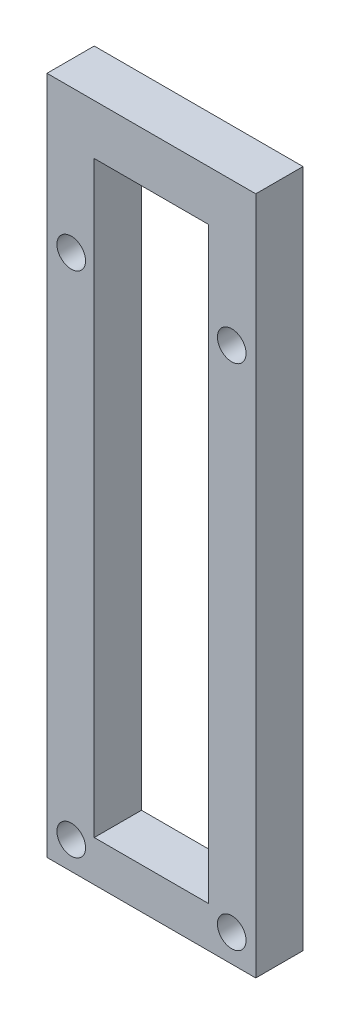
ISO-10303-21;
HEADER;
FILE_DESCRIPTION(('STEP AP214'),'2;1');
FILE_NAME('part.step','',(''),(''),'','','');
FILE_SCHEMA(('AUTOMOTIVE_DESIGN { 1 0 10303 214 1 1 1 1 }'));
ENDSEC;
DATA;
#1=APPLICATION_CONTEXT('core data for automotive mechanical design processes');
#2=APPLICATION_PROTOCOL_DEFINITION('international standard','automotive_design',2000,#1);
#3=PRODUCT_CONTEXT('',#1,'mechanical');
#4=PRODUCT('Part','Part','',(#3));
#5=PRODUCT_RELATED_PRODUCT_CATEGORY('part','',(#4));
#6=PRODUCT_DEFINITION_FORMATION('','',#4);
#7=PRODUCT_DEFINITION_CONTEXT('part definition',#1,'design');
#8=PRODUCT_DEFINITION('design','',#6,#7);
#9=PRODUCT_DEFINITION_SHAPE('','',#8);
#10=(LENGTH_UNIT() NAMED_UNIT(*) SI_UNIT(.MILLI.,.METRE.));
#11=(NAMED_UNIT(*) PLANE_ANGLE_UNIT() SI_UNIT($,.RADIAN.));
#12=(NAMED_UNIT(*) SI_UNIT($,.STERADIAN.) SOLID_ANGLE_UNIT());
#13=UNCERTAINTY_MEASURE_WITH_UNIT(LENGTH_MEASURE(1.E-05),#10,'distance_accuracy_value','');
#14=(GEOMETRIC_REPRESENTATION_CONTEXT(3) GLOBAL_UNCERTAINTY_ASSIGNED_CONTEXT((#13)) GLOBAL_UNIT_ASSIGNED_CONTEXT((#10,
#11,#12)) REPRESENTATION_CONTEXT('',''));
#15=CARTESIAN_POINT('',(0.,0.,0.));
#16=DIRECTION('',(0.,0.,1.));
#17=DIRECTION('',(1.,0.,0.));
#18=AXIS2_PLACEMENT_3D('',#15,#16,#17);
#19=CARTESIAN_POINT('',(-6.6,94.86,6.6));
#20=DIRECTION('',(1.,0.,0.));
#21=DIRECTION('',(0.,1.,0.));
#22=AXIS2_PLACEMENT_3D('',#19,#20,#21);
#23=PLANE('',#22);
#24=DIRECTION('',(0.,0.,-1.));
#25=VECTOR('',#24,1.);
#26=CARTESIAN_POINT('',(-6.59999999999172,87.8560754392765,6.6));
#27=LINE('',#26,#25);
#28=CARTESIAN_POINT('',(-6.6,87.8560754392765,6.6));
#29=VERTEX_POINT('',#28);
#30=CARTESIAN_POINT('',(-6.59999999999172,87.8560754392765,0.));
#31=VERTEX_POINT('',#30);
#32=EDGE_CURVE('E114',#29,#31,#27,.T.);
#33=ORIENTED_EDGE('',*,*,#32,.T.);
#34=DIRECTION('',(0.,-1.,0.));
#35=VECTOR('',#34,1.);
#36=CARTESIAN_POINT('',(-6.6,94.86,0.));
#37=LINE('',#36,#35);
#38=CARTESIAN_POINT('',(-6.59999999999999,5.70999999999999,0.));
#39=VERTEX_POINT('',#38);
#40=EDGE_CURVE('E104',#31,#39,#37,.T.);
#41=ORIENTED_EDGE('',*,*,#40,.T.);
#42=DIRECTION('',(0.,0.,-1.));
#43=VECTOR('',#42,1.);
#44=CARTESIAN_POINT('',(-6.59999999999999,5.70999999999999,6.6));
#45=LINE('',#44,#43);
#46=CARTESIAN_POINT('',(-6.59999999999999,5.70999999999999,6.6));
#47=VERTEX_POINT('',#46);
#48=EDGE_CURVE('E161',#47,#39,#45,.T.);
#49=ORIENTED_EDGE('',*,*,#48,.F.);
#50=DIRECTION('',(0.,-1.,0.));
#51=VECTOR('',#50,1.);
#52=CARTESIAN_POINT('',(-6.6,94.86,6.6));
#53=LINE('',#52,#51);
#54=EDGE_CURVE('E60',#29,#47,#53,.T.);
#55=ORIENTED_EDGE('',*,*,#54,.F.);
#56=EDGE_LOOP('',(#33,#41,#49,#55));
#57=FACE_BOUND('',#56,.T.);
#58=ADVANCED_FACE('F35',(#57),#23,.F.);
#59=CARTESIAN_POINT('',(-22.56,5.70999999999999,6.6));
#60=DIRECTION('',(-1.,0.,0.));
#61=DIRECTION('',(0.,0.,1.));
#62=AXIS2_PLACEMENT_3D('',#59,#60,#61);
#63=PLANE('',#62);
#64=DIRECTION('',(0.,0.,-1.));
#65=VECTOR('',#64,1.);
#66=CARTESIAN_POINT('',(-22.56,87.8560754392765,6.6));
#67=LINE('',#66,#65);
#68=CARTESIAN_POINT('',(-22.56,87.8560754392765,6.6));
#69=VERTEX_POINT('',#68);
#70=CARTESIAN_POINT('',(-22.56,87.8560754392765,0.));
#71=VERTEX_POINT('',#70);
#72=EDGE_CURVE('E52',#69,#71,#67,.T.);
#73=ORIENTED_EDGE('',*,*,#72,.F.);
#74=DIRECTION('',(0.,1.,0.));
#75=VECTOR('',#74,1.);
#76=CARTESIAN_POINT('',(-22.56,5.70999999999999,6.6));
#77=LINE('',#76,#75);
#78=CARTESIAN_POINT('',(-22.56,5.70999999999999,6.6));
#79=VERTEX_POINT('',#78);
#80=EDGE_CURVE('E138',#79,#69,#77,.T.);
#81=ORIENTED_EDGE('',*,*,#80,.F.);
#82=DIRECTION('',(0.,0.,-1.));
#83=VECTOR('',#82,1.);
#84=CARTESIAN_POINT('',(-22.56,5.70999999999999,6.6));
#85=LINE('',#84,#83);
#86=CARTESIAN_POINT('',(-22.56,5.70999999999999,0.));
#87=VERTEX_POINT('',#86);
#88=EDGE_CURVE('E158',#79,#87,#85,.T.);
#89=ORIENTED_EDGE('',*,*,#88,.T.);
#90=DIRECTION('',(0.,1.,0.));
#91=VECTOR('',#90,1.);
#92=CARTESIAN_POINT('',(-22.56,5.70999999999999,0.));
#93=LINE('',#92,#91);
#94=EDGE_CURVE('E148',#87,#71,#93,.T.);
#95=ORIENTED_EDGE('',*,*,#94,.T.);
#96=EDGE_LOOP('',(#73,#81,#89,#95));
#97=FACE_BOUND('',#96,.T.);
#98=ADVANCED_FACE('F224',(#97),#63,.F.);
#99=CARTESIAN_POINT('',(-29.16,0.,6.6));
#100=DIRECTION('',(0.,1.,0.));
#101=DIRECTION('',(0.,0.,1.));
#102=AXIS2_PLACEMENT_3D('',#99,#100,#101);
#103=PLANE('',#102);
#104=DIRECTION('',(1.,0.,0.));
#105=VECTOR('',#104,1.);
#106=CARTESIAN_POINT('',(-29.16,0.,0.));
#107=LINE('',#106,#105);
#108=CARTESIAN_POINT('',(-29.16,0.,0.));
#109=VERTEX_POINT('',#108);
#110=CARTESIAN_POINT('',(0.,0.,0.));
#111=VERTEX_POINT('',#110);
#112=EDGE_CURVE('E123',#109,#111,#107,.T.);
#113=ORIENTED_EDGE('',*,*,#112,.T.);
#114=DIRECTION('',(0.,0.,-1.));
#115=VECTOR('',#114,1.);
#116=CARTESIAN_POINT('',(0.,0.,6.6));
#117=LINE('',#116,#115);
#118=CARTESIAN_POINT('',(0.,0.,6.6));
#119=VERTEX_POINT('',#118);
#120=EDGE_CURVE('E11',#119,#111,#117,.T.);
#121=ORIENTED_EDGE('',*,*,#120,.F.);
#122=DIRECTION('',(1.,0.,0.));
#123=VECTOR('',#122,1.);
#124=CARTESIAN_POINT('',(-29.16,0.,6.6));
#125=LINE('',#124,#123);
#126=CARTESIAN_POINT('',(-29.16,0.,6.6));
#127=VERTEX_POINT('',#126);
#128=EDGE_CURVE('E127',#127,#119,#125,.T.);
#129=ORIENTED_EDGE('',*,*,#128,.F.);
#130=DIRECTION('',(0.,0.,-1.));
#131=VECTOR('',#130,1.);
#132=CARTESIAN_POINT('',(-29.16,0.,6.6));
#133=LINE('',#132,#131);
#134=EDGE_CURVE('E142',#127,#109,#133,.T.);
#135=ORIENTED_EDGE('',*,*,#134,.T.);
#136=EDGE_LOOP('',(#113,#121,#129,#135));
#137=FACE_BOUND('',#136,.T.);
#138=ADVANCED_FACE('F37',(#137),#103,.F.);
#139=CARTESIAN_POINT('',(0.,0.,6.6));
#140=DIRECTION('',(-1.,0.,0.));
#141=DIRECTION('',(0.,0.,1.));
#142=AXIS2_PLACEMENT_3D('',#139,#140,#141);
#143=PLANE('',#142);
#144=DIRECTION('',(0.,1.,0.));
#145=VECTOR('',#144,1.);
#146=CARTESIAN_POINT('',(0.,0.,0.));
#147=LINE('',#146,#145);
#148=CARTESIAN_POINT('',(0.,94.86,0.));
#149=VERTEX_POINT('',#148);
#150=EDGE_CURVE('E112',#111,#149,#147,.T.);
#151=ORIENTED_EDGE('',*,*,#150,.T.);
#152=DIRECTION('',(0.,0.,-1.));
#153=VECTOR('',#152,1.);
#154=CARTESIAN_POINT('',(0.,94.86,6.6));
#155=LINE('',#154,#153);
#156=CARTESIAN_POINT('',(0.,94.86,6.6));
#157=VERTEX_POINT('',#156);
#158=EDGE_CURVE('E44',#157,#149,#155,.T.);
#159=ORIENTED_EDGE('',*,*,#158,.F.);
#160=DIRECTION('',(0.,1.,0.));
#161=VECTOR('',#160,1.);
#162=CARTESIAN_POINT('',(0.,0.,6.6));
#163=LINE('',#162,#161);
#164=EDGE_CURVE('E130',#119,#157,#163,.T.);
#165=ORIENTED_EDGE('',*,*,#164,.F.);
#166=ORIENTED_EDGE('',*,*,#120,.T.);
#167=EDGE_LOOP('',(#151,#159,#165,#166));
#168=FACE_BOUND('',#167,.T.);
#169=ADVANCED_FACE('F208',(#168),#143,.F.);
#170=CARTESIAN_POINT('',(-6.59999999999999,5.70999999999999,6.6));
#171=DIRECTION('',(0.,-1.,0.));
#172=DIRECTION('',(1.,0.,0.));
#173=AXIS2_PLACEMENT_3D('',#170,#171,#172);
#174=PLANE('',#173);
#175=DIRECTION('',(-1.,0.,0.));
#176=VECTOR('',#175,1.);
#177=CARTESIAN_POINT('',(-6.59999999999999,5.70999999999999,0.));
#178=LINE('',#177,#176);
#179=EDGE_CURVE('E110',#39,#87,#178,.T.);
#180=ORIENTED_EDGE('',*,*,#179,.T.);
#181=ORIENTED_EDGE('',*,*,#88,.F.);
#182=DIRECTION('',(-1.,0.,0.));
#183=VECTOR('',#182,1.);
#184=CARTESIAN_POINT('',(-6.59999999999999,5.70999999999999,6.6));
#185=LINE('',#184,#183);
#186=EDGE_CURVE('E136',#47,#79,#185,.T.);
#187=ORIENTED_EDGE('',*,*,#186,.F.);
#188=ORIENTED_EDGE('',*,*,#48,.T.);
#189=EDGE_LOOP('',(#180,#181,#187,#188));
#190=FACE_BOUND('',#189,.T.);
#191=ADVANCED_FACE('F231',(#190),#174,.F.);
#192=CARTESIAN_POINT('',(-22.56,94.86,6.6));
#193=DIRECTION('',(0.,-1.,0.));
#194=DIRECTION('',(0.,0.,-1.));
#195=AXIS2_PLACEMENT_3D('',#192,#193,#194);
#196=PLANE('',#195);
#197=DIRECTION('',(-1.,0.,0.));
#198=VECTOR('',#197,1.);
#199=CARTESIAN_POINT('',(-22.56,94.86,0.));
#200=LINE('',#199,#198);
#201=CARTESIAN_POINT('',(-29.16,94.86,0.));
#202=VERTEX_POINT('',#201);
#203=EDGE_CURVE('E150',#149,#202,#200,.T.);
#204=ORIENTED_EDGE('',*,*,#203,.T.);
#205=DIRECTION('',(0.,0.,-1.));
#206=VECTOR('',#205,1.);
#207=CARTESIAN_POINT('',(-29.16,94.86,6.6));
#208=LINE('',#207,#206);
#209=CARTESIAN_POINT('',(-29.16,94.86,6.6));
#210=VERTEX_POINT('',#209);
#211=EDGE_CURVE('E155',#210,#202,#208,.T.);
#212=ORIENTED_EDGE('',*,*,#211,.F.);
#213=DIRECTION('',(-1.,0.,0.));
#214=VECTOR('',#213,1.);
#215=CARTESIAN_POINT('',(0.,94.86,6.6));
#216=LINE('',#215,#214);
#217=EDGE_CURVE('E133',#157,#210,#216,.T.);
#218=ORIENTED_EDGE('',*,*,#217,.F.);
#219=ORIENTED_EDGE('',*,*,#158,.T.);
#220=EDGE_LOOP('',(#204,#212,#218,#219));
#221=FACE_BOUND('',#220,.T.);
#222=ADVANCED_FACE('F212',(#221),#196,.F.);
#223=CARTESIAN_POINT('',(-29.16,94.86,6.6));
#224=DIRECTION('',(1.,0.,0.));
#225=DIRECTION('',(0.,0.,-1.));
#226=AXIS2_PLACEMENT_3D('',#223,#224,#225);
#227=PLANE('',#226);
#228=DIRECTION('',(0.,-1.,0.));
#229=VECTOR('',#228,1.);
#230=CARTESIAN_POINT('',(-29.16,94.86,0.));
#231=LINE('',#230,#229);
#232=EDGE_CURVE('E131',#202,#109,#231,.T.);
#233=ORIENTED_EDGE('',*,*,#232,.T.);
#234=ORIENTED_EDGE('',*,*,#134,.F.);
#235=DIRECTION('',(0.,-1.,0.));
#236=VECTOR('',#235,1.);
#237=CARTESIAN_POINT('',(-29.16,94.86,6.6));
#238=LINE('',#237,#236);
#239=EDGE_CURVE('E140',#210,#127,#238,.T.);
#240=ORIENTED_EDGE('',*,*,#239,.F.);
#241=ORIENTED_EDGE('',*,*,#211,.T.);
#242=EDGE_LOOP('',(#233,#234,#240,#241));
#243=FACE_BOUND('',#242,.T.);
#244=ADVANCED_FACE('F196',(#243),#227,.F.);
#245=CARTESIAN_POINT('',(0.,0.,6.6));
#246=DIRECTION('',(0.,0.,1.));
#247=DIRECTION('',(1.,0.,0.));
#248=AXIS2_PLACEMENT_3D('',#245,#246,#247);
#249=PLANE('',#248);
#250=CARTESIAN_POINT('',(-3.35435339282858,74.86,6.6));
#251=DIRECTION('',(0.,0.,1.));
#252=DIRECTION('',(1.,0.,0.));
#253=AXIS2_PLACEMENT_3D('',#250,#251,#252);
#254=CIRCLE('',#253,2.);
#255=CARTESIAN_POINT('',(-1.35435339282858,74.86,6.6));
#256=VERTEX_POINT('',#255);
#257=EDGE_CURVE('E183',#256,#256,#254,.T.);
#258=ORIENTED_EDGE('',*,*,#257,.F.);
#259=EDGE_LOOP('',(#258));
#260=FACE_BOUND('',#259,.T.);
#261=CARTESIAN_POINT('',(-25.7710243855859,74.86,6.6));
#262=DIRECTION('',(0.,0.,1.));
#263=DIRECTION('',(1.,0.,0.));
#264=AXIS2_PLACEMENT_3D('',#261,#262,#263);
#265=CIRCLE('',#264,2.);
#266=CARTESIAN_POINT('',(-23.7710243855859,74.86,6.6));
#267=VERTEX_POINT('',#266);
#268=EDGE_CURVE('E173',#267,#267,#265,.T.);
#269=ORIENTED_EDGE('',*,*,#268,.F.);
#270=EDGE_LOOP('',(#269));
#271=FACE_BOUND('',#270,.T.);
#272=CARTESIAN_POINT('',(-3.35435339282858,3.86,6.6));
#273=DIRECTION('',(0.,0.,1.));
#274=DIRECTION('',(1.,0.,0.));
#275=AXIS2_PLACEMENT_3D('',#272,#273,#274);
#276=CIRCLE('',#275,2.);
#277=CARTESIAN_POINT('',(-1.35435339282858,3.86,6.6));
#278=VERTEX_POINT('',#277);
#279=EDGE_CURVE('E170',#278,#278,#276,.T.);
#280=ORIENTED_EDGE('',*,*,#279,.F.);
#281=EDGE_LOOP('',(#280));
#282=FACE_BOUND('',#281,.T.);
#283=CARTESIAN_POINT('',(-25.7710243855859,3.86,6.6));
#284=DIRECTION('',(0.,0.,1.));
#285=DIRECTION('',(1.,0.,0.));
#286=AXIS2_PLACEMENT_3D('',#283,#284,#285);
#287=CIRCLE('',#286,2.);
#288=CARTESIAN_POINT('',(-23.7710243855859,3.86,6.6));
#289=VERTEX_POINT('',#288);
#290=EDGE_CURVE('E167',#289,#289,#287,.T.);
#291=ORIENTED_EDGE('',*,*,#290,.F.);
#292=EDGE_LOOP('',(#291));
#293=FACE_BOUND('',#292,.T.);
#294=DIRECTION('',(-1.,0.,0.));
#295=VECTOR('',#294,1.);
#296=CARTESIAN_POINT('',(500000.,87.8560754392765,6.6));
#297=LINE('',#296,#295);
#298=EDGE_CURVE('E118',#29,#69,#297,.T.);
#299=ORIENTED_EDGE('',*,*,#298,.F.);
#300=ORIENTED_EDGE('',*,*,#54,.T.);
#301=ORIENTED_EDGE('',*,*,#186,.T.);
#302=ORIENTED_EDGE('',*,*,#80,.T.);
#303=EDGE_LOOP('',(#299,#300,#301,#302));
#304=FACE_BOUND('',#303,.T.);
#305=ORIENTED_EDGE('',*,*,#128,.T.);
#306=ORIENTED_EDGE('',*,*,#164,.T.);
#307=ORIENTED_EDGE('',*,*,#217,.T.);
#308=ORIENTED_EDGE('',*,*,#239,.T.);
#309=EDGE_LOOP('',(#305,#306,#307,#308));
#310=FACE_BOUND('',#309,.T.);
#311=ADVANCED_FACE('F193',(#260,#271,#282,#293,#304,#310),#249,.T.);
#312=CARTESIAN_POINT('',(0.,0.,0.));
#313=DIRECTION('',(0.,0.,1.));
#314=DIRECTION('',(1.,0.,0.));
#315=AXIS2_PLACEMENT_3D('',#312,#313,#314);
#316=PLANE('',#315);
#317=CARTESIAN_POINT('',(-3.35435339282858,74.86,0.));
#318=DIRECTION('',(0.,0.,1.));
#319=DIRECTION('',(1.,0.,0.));
#320=AXIS2_PLACEMENT_3D('',#317,#318,#319);
#321=CIRCLE('',#320,2.);
#322=CARTESIAN_POINT('',(-1.35435339282858,74.86,0.));
#323=VERTEX_POINT('',#322);
#324=EDGE_CURVE('E39',#323,#323,#321,.T.);
#325=ORIENTED_EDGE('',*,*,#324,.T.);
#326=EDGE_LOOP('',(#325));
#327=FACE_BOUND('',#326,.T.);
#328=CARTESIAN_POINT('',(-25.7710243855859,74.86,0.));
#329=DIRECTION('',(0.,0.,1.));
#330=DIRECTION('',(1.,0.,0.));
#331=AXIS2_PLACEMENT_3D('',#328,#329,#330);
#332=CIRCLE('',#331,2.);
#333=CARTESIAN_POINT('',(-23.7710243855859,74.86,0.));
#334=VERTEX_POINT('',#333);
#335=EDGE_CURVE('E171',#334,#334,#332,.T.);
#336=ORIENTED_EDGE('',*,*,#335,.T.);
#337=EDGE_LOOP('',(#336));
#338=FACE_BOUND('',#337,.T.);
#339=CARTESIAN_POINT('',(-3.35435339282858,3.86,0.));
#340=DIRECTION('',(0.,0.,1.));
#341=DIRECTION('',(1.,0.,0.));
#342=AXIS2_PLACEMENT_3D('',#339,#340,#341);
#343=CIRCLE('',#342,2.);
#344=CARTESIAN_POINT('',(-1.35435339282858,3.86,0.));
#345=VERTEX_POINT('',#344);
#346=EDGE_CURVE('E168',#345,#345,#343,.T.);
#347=ORIENTED_EDGE('',*,*,#346,.T.);
#348=EDGE_LOOP('',(#347));
#349=FACE_BOUND('',#348,.T.);
#350=CARTESIAN_POINT('',(-25.7710243855859,3.86,0.));
#351=DIRECTION('',(0.,0.,1.));
#352=DIRECTION('',(1.,0.,0.));
#353=AXIS2_PLACEMENT_3D('',#350,#351,#352);
#354=CIRCLE('',#353,2.);
#355=CARTESIAN_POINT('',(-23.7710243855859,3.86,0.));
#356=VERTEX_POINT('',#355);
#357=EDGE_CURVE('E119',#356,#356,#354,.T.);
#358=ORIENTED_EDGE('',*,*,#357,.T.);
#359=EDGE_LOOP('',(#358));
#360=FACE_BOUND('',#359,.T.);
#361=CARTESIAN_POINT('',(-25.7710243855859,47.4280623629322,0.));
#362=DIRECTION('',(0.,0.,1.));
#363=DIRECTION('',(1.,0.,0.));
#364=AXIS2_PLACEMENT_3D('',#361,#362,#363);
#365=CIRCLE('',#364,2.);
#366=CARTESIAN_POINT('',(-23.7710243855859,47.4280623629322,0.));
#367=VERTEX_POINT('',#366);
#368=EDGE_CURVE('E367',#367,#367,#365,.T.);
#369=ORIENTED_EDGE('',*,*,#368,.T.);
#370=EDGE_LOOP('',(#369));
#371=FACE_BOUND('',#370,.T.);
#372=CARTESIAN_POINT('',(-3.35435339282858,47.4280623629322,0.));
#373=DIRECTION('',(0.,0.,1.));
#374=DIRECTION('',(1.,0.,0.));
#375=AXIS2_PLACEMENT_3D('',#372,#373,#374);
#376=CIRCLE('',#375,2.);
#377=CARTESIAN_POINT('',(-1.35435339282858,47.4280623629322,0.));
#378=VERTEX_POINT('',#377);
#379=EDGE_CURVE('E360',#378,#378,#376,.T.);
#380=ORIENTED_EDGE('',*,*,#379,.T.);
#381=EDGE_LOOP('',(#380));
#382=FACE_BOUND('',#381,.T.);
#383=ORIENTED_EDGE('',*,*,#40,.F.);
#384=DIRECTION('',(-1.,0.,0.));
#385=VECTOR('',#384,1.);
#386=CARTESIAN_POINT('',(500000.,87.8560754392765,0.));
#387=LINE('',#386,#385);
#388=EDGE_CURVE('E109',#31,#71,#387,.T.);
#389=ORIENTED_EDGE('',*,*,#388,.T.);
#390=ORIENTED_EDGE('',*,*,#94,.F.);
#391=ORIENTED_EDGE('',*,*,#179,.F.);
#392=EDGE_LOOP('',(#383,#389,#390,#391));
#393=FACE_BOUND('',#392,.T.);
#394=ORIENTED_EDGE('',*,*,#112,.F.);
#395=ORIENTED_EDGE('',*,*,#232,.F.);
#396=ORIENTED_EDGE('',*,*,#203,.F.);
#397=ORIENTED_EDGE('',*,*,#150,.F.);
#398=EDGE_LOOP('',(#394,#395,#396,#397));
#399=FACE_BOUND('',#398,.T.);
#400=ADVANCED_FACE('F105',(#327,#338,#349,#360,#371,#382,#393,#399),#316,.F.);
#401=CARTESIAN_POINT('',(500000.,87.8560754392765,6.6));
#402=DIRECTION('',(0.,1.,0.));
#403=DIRECTION('',(0.,0.,1.));
#404=AXIS2_PLACEMENT_3D('',#401,#402,#403);
#405=PLANE('',#404);
#406=ORIENTED_EDGE('',*,*,#32,.F.);
#407=ORIENTED_EDGE('',*,*,#298,.T.);
#408=ORIENTED_EDGE('',*,*,#72,.T.);
#409=ORIENTED_EDGE('',*,*,#388,.F.);
#410=EDGE_LOOP('',(#406,#407,#408,#409));
#411=FACE_BOUND('',#410,.T.);
#412=ADVANCED_FACE('F121',(#411),#405,.F.);
#413=CARTESIAN_POINT('',(-25.7710243855859,3.86,-8.4));
#414=DIRECTION('',(0.,0.,1.));
#415=DIRECTION('',(1.,0.,0.));
#416=AXIS2_PLACEMENT_3D('',#413,#414,#415);
#417=CYLINDRICAL_SURFACE('',#416,2.);
#418=ORIENTED_EDGE('',*,*,#290,.T.);
#419=EDGE_LOOP('',(#418));
#420=FACE_BOUND('',#419,.T.);
#421=ORIENTED_EDGE('',*,*,#357,.F.);
#422=EDGE_LOOP('',(#421));
#423=FACE_BOUND('',#422,.T.);
#424=ADVANCED_FACE('F190',(#420,#423),#417,.F.);
#425=CARTESIAN_POINT('',(-3.35435339282858,3.86,-8.4));
#426=DIRECTION('',(0.,0.,1.));
#427=DIRECTION('',(1.,0.,0.));
#428=AXIS2_PLACEMENT_3D('',#425,#426,#427);
#429=CYLINDRICAL_SURFACE('',#428,2.);
#430=ORIENTED_EDGE('',*,*,#279,.T.);
#431=EDGE_LOOP('',(#430));
#432=FACE_BOUND('',#431,.T.);
#433=ORIENTED_EDGE('',*,*,#346,.F.);
#434=EDGE_LOOP('',(#433));
#435=FACE_BOUND('',#434,.T.);
#436=ADVANCED_FACE('F278',(#432,#435),#429,.F.);
#437=CARTESIAN_POINT('',(-25.7710243855859,74.86,-8.4));
#438=DIRECTION('',(0.,0.,1.));
#439=DIRECTION('',(1.,0.,0.));
#440=AXIS2_PLACEMENT_3D('',#437,#438,#439);
#441=CYLINDRICAL_SURFACE('',#440,2.);
#442=ORIENTED_EDGE('',*,*,#268,.T.);
#443=EDGE_LOOP('',(#442));
#444=FACE_BOUND('',#443,.T.);
#445=ORIENTED_EDGE('',*,*,#335,.F.);
#446=EDGE_LOOP('',(#445));
#447=FACE_BOUND('',#446,.T.);
#448=ADVANCED_FACE('F287',(#444,#447),#441,.F.);
#449=CARTESIAN_POINT('',(-3.35435339282858,74.86,-8.4));
#450=DIRECTION('',(0.,0.,1.));
#451=DIRECTION('',(1.,0.,0.));
#452=AXIS2_PLACEMENT_3D('',#449,#450,#451);
#453=CYLINDRICAL_SURFACE('',#452,2.);
#454=ORIENTED_EDGE('',*,*,#257,.T.);
#455=EDGE_LOOP('',(#454));
#456=FACE_BOUND('',#455,.T.);
#457=ORIENTED_EDGE('',*,*,#324,.F.);
#458=EDGE_LOOP('',(#457));
#459=FACE_BOUND('',#458,.T.);
#460=ADVANCED_FACE('F297',(#456,#459),#453,.F.);
#461=CARTESIAN_POINT('',(-25.7710243855859,47.4280623629322,-0.0900000000000007));
#462=DIRECTION('',(0.,0.,1.));
#463=DIRECTION('',(1.,0.,0.));
#464=AXIS2_PLACEMENT_3D('',#461,#462,#463);
#465=CYLINDRICAL_SURFACE('',#464,2.);
#466=CARTESIAN_POINT('',(-25.7710243855859,47.4280623629322,-0.0900000000000007));
#467=DIRECTION('',(0.,0.,1.));
#468=DIRECTION('',(1.,0.,0.));
#469=AXIS2_PLACEMENT_3D('',#466,#467,#468);
#470=CIRCLE('',#469,2.);
#471=CARTESIAN_POINT('',(-23.7710243855859,47.4280623629322,-0.0900000000000007));
#472=VERTEX_POINT('',#471);
#473=EDGE_CURVE('E363',#472,#472,#470,.T.);
#474=ORIENTED_EDGE('',*,*,#473,.T.);
#475=EDGE_LOOP('',(#474));
#476=FACE_BOUND('',#475,.T.);
#477=ORIENTED_EDGE('',*,*,#368,.F.);
#478=EDGE_LOOP('',(#477));
#479=FACE_BOUND('',#478,.T.);
#480=ADVANCED_FACE('F306',(#476,#479),#465,.T.);
#481=CARTESIAN_POINT('',(-25.7710243855859,47.4280623629322,-0.0900000000000007));
#482=DIRECTION('',(0.,0.,1.));
#483=DIRECTION('',(1.,0.,0.));
#484=AXIS2_PLACEMENT_3D('',#481,#482,#483);
#485=PLANE('',#484);
#486=ORIENTED_EDGE('',*,*,#473,.F.);
#487=EDGE_LOOP('',(#486));
#488=FACE_BOUND('',#487,.T.);
#489=ADVANCED_FACE('F323',(#488),#485,.F.);
#490=CARTESIAN_POINT('',(-3.35435339282858,47.4280623629322,-0.0900000000000007));
#491=DIRECTION('',(0.,0.,1.));
#492=DIRECTION('',(1.,0.,0.));
#493=AXIS2_PLACEMENT_3D('',#490,#491,#492);
#494=CYLINDRICAL_SURFACE('',#493,2.);
#495=CARTESIAN_POINT('',(-3.35435339282858,47.4280623629322,-0.0900000000000007));
#496=DIRECTION('',(0.,0.,1.));
#497=DIRECTION('',(1.,0.,0.));
#498=AXIS2_PLACEMENT_3D('',#495,#496,#497);
#499=CIRCLE('',#498,2.);
#500=CARTESIAN_POINT('',(-1.35435339282858,47.4280623629322,-0.0900000000000007));
#501=VERTEX_POINT('',#500);
#502=EDGE_CURVE('E359',#501,#501,#499,.T.);
#503=ORIENTED_EDGE('',*,*,#502,.T.);
#504=EDGE_LOOP('',(#503));
#505=FACE_BOUND('',#504,.T.);
#506=ORIENTED_EDGE('',*,*,#379,.F.);
#507=EDGE_LOOP('',(#506));
#508=FACE_BOUND('',#507,.T.);
#509=ADVANCED_FACE('F333',(#505,#508),#494,.T.);
#510=CARTESIAN_POINT('',(-3.35435339282858,47.4280623629322,-0.0900000000000007));
#511=DIRECTION('',(0.,0.,1.));
#512=DIRECTION('',(1.,0.,0.));
#513=AXIS2_PLACEMENT_3D('',#510,#511,#512);
#514=PLANE('',#513);
#515=ORIENTED_EDGE('',*,*,#502,.F.);
#516=EDGE_LOOP('',(#515));
#517=FACE_BOUND('',#516,.T.);
#518=ADVANCED_FACE('F343',(#517),#514,.F.);
#519=CLOSED_SHELL('',(#58,#98,#138,#169,#191,#222,#244,#311,#400,#412,#424,#436,#448,#460,#480,
#489,#509,#518));
#520=MANIFOLD_SOLID_BREP('B2',#519);
#521=ADVANCED_BREP_SHAPE_REPRESENTATION('',(#18,#520),#14);
#522=SHAPE_DEFINITION_REPRESENTATION(#9,#521);
ENDSEC;
END-ISO-10303-21;
